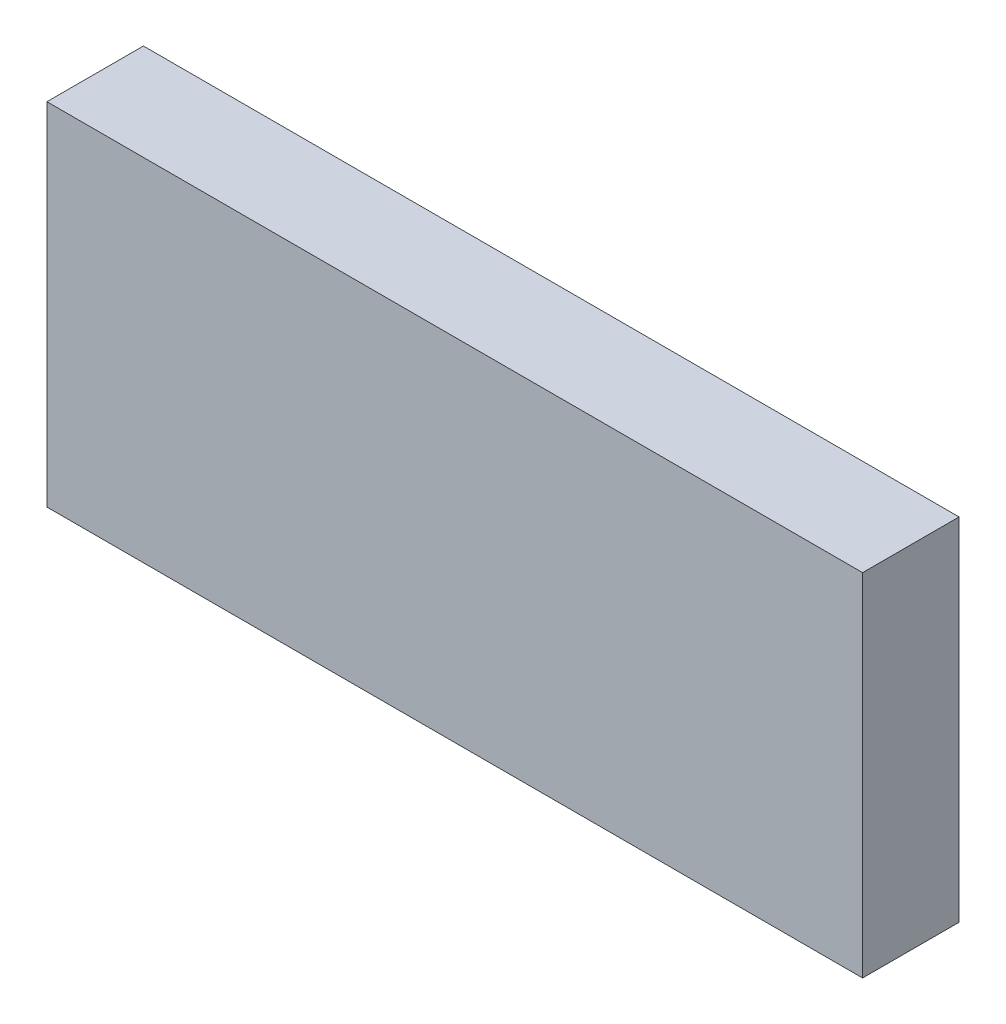
ISO-10303-21;
HEADER;
FILE_DESCRIPTION(('STEP AP214'),'2;1');
FILE_NAME('part.step','',(''),(''),'','','');
FILE_SCHEMA(('AUTOMOTIVE_DESIGN { 1 0 10303 214 1 1 1 1 }'));
ENDSEC;
DATA;
#1=APPLICATION_CONTEXT('core data for automotive mechanical design processes');
#2=APPLICATION_PROTOCOL_DEFINITION('international standard','automotive_design',2000,#1);
#3=PRODUCT_CONTEXT('',#1,'mechanical');
#4=PRODUCT('Part','Part','',(#3));
#5=PRODUCT_RELATED_PRODUCT_CATEGORY('part','',(#4));
#6=PRODUCT_DEFINITION_FORMATION('','',#4);
#7=PRODUCT_DEFINITION_CONTEXT('part definition',#1,'design');
#8=PRODUCT_DEFINITION('design','',#6,#7);
#9=PRODUCT_DEFINITION_SHAPE('','',#8);
#10=(LENGTH_UNIT() NAMED_UNIT(*) SI_UNIT(.MILLI.,.METRE.));
#11=(NAMED_UNIT(*) PLANE_ANGLE_UNIT() SI_UNIT($,.RADIAN.));
#12=(NAMED_UNIT(*) SI_UNIT($,.STERADIAN.) SOLID_ANGLE_UNIT());
#13=UNCERTAINTY_MEASURE_WITH_UNIT(LENGTH_MEASURE(1.E-05),#10,'distance_accuracy_value','');
#14=(GEOMETRIC_REPRESENTATION_CONTEXT(3) GLOBAL_UNCERTAINTY_ASSIGNED_CONTEXT((#13)) GLOBAL_UNIT_ASSIGNED_CONTEXT((#10,
#11,#12)) REPRESENTATION_CONTEXT('',''));
#15=CARTESIAN_POINT('',(0.,0.,0.));
#16=DIRECTION('',(0.,0.,1.));
#17=DIRECTION('',(1.,0.,0.));
#18=AXIS2_PLACEMENT_3D('',#15,#16,#17);
#19=CARTESIAN_POINT('',(3291.814453,0.,0.));
#20=DIRECTION('',(1.,0.,0.));
#21=DIRECTION('',(0.,0.,-1.));
#22=AXIS2_PLACEMENT_3D('',#19,#20,#21);
#23=PLANE('',#22);
#24=DIRECTION('',(0.,1.,0.));
#25=VECTOR('',#24,1.);
#26=CARTESIAN_POINT('',(3291.814453,0.,-1501.));
#27=LINE('',#26,#25);
#28=CARTESIAN_POINT('',(3291.814453,-2100.673096,-1501.));
#29=VERTEX_POINT('',#28);
#30=CARTESIAN_POINT('',(3291.814453,1611.235962,-1501.));
#31=VERTEX_POINT('',#30);
#32=EDGE_CURVE('E74',#29,#31,#27,.T.);
#33=ORIENTED_EDGE('',*,*,#32,.T.);
#34=DIRECTION('',(0.,0.,-1.));
#35=VECTOR('',#34,1.);
#36=CARTESIAN_POINT('',(3291.814453,1611.235962,0.));
#37=LINE('',#36,#35);
#38=CARTESIAN_POINT('',(3291.814453,1611.235962,-481.));
#39=VERTEX_POINT('',#38);
#40=EDGE_CURVE('E60',#31,#39,#37,.F.);
#41=ORIENTED_EDGE('',*,*,#40,.T.);
#42=DIRECTION('',(0.,1.,0.));
#43=VECTOR('',#42,1.);
#44=CARTESIAN_POINT('',(3291.814453,0.,-481.));
#45=LINE('',#44,#43);
#46=CARTESIAN_POINT('',(3291.814453,-2100.673096,-481.));
#47=VERTEX_POINT('',#46);
#48=EDGE_CURVE('E20',#39,#47,#45,.F.);
#49=ORIENTED_EDGE('',*,*,#48,.T.);
#50=DIRECTION('',(0.,0.,1.));
#51=VECTOR('',#50,1.);
#52=CARTESIAN_POINT('',(3291.814453,-2100.673096,0.));
#53=LINE('',#52,#51);
#54=EDGE_CURVE('E55',#47,#29,#53,.F.);
#55=ORIENTED_EDGE('',*,*,#54,.T.);
#56=EDGE_LOOP('',(#33,#41,#49,#55));
#57=FACE_BOUND('',#56,.T.);
#58=ADVANCED_FACE('F17',(#57),#23,.T.);
#59=CARTESIAN_POINT('',(0.,0.,-481.));
#60=DIRECTION('',(0.,0.,1.));
#61=DIRECTION('',(1.,0.,0.));
#62=AXIS2_PLACEMENT_3D('',#59,#60,#61);
#63=PLANE('',#62);
#64=DIRECTION('',(1.,0.,0.));
#65=VECTOR('',#64,1.);
#66=CARTESIAN_POINT('',(0.,-2100.673096,-481.));
#67=LINE('',#66,#65);
#68=CARTESIAN_POINT('',(-5332.509766,-2100.673096,-481.));
#69=VERTEX_POINT('',#68);
#70=EDGE_CURVE('E63',#69,#47,#67,.T.);
#71=ORIENTED_EDGE('',*,*,#70,.T.);
#72=ORIENTED_EDGE('',*,*,#48,.F.);
#73=DIRECTION('',(1.,0.,0.));
#74=VECTOR('',#73,1.);
#75=CARTESIAN_POINT('',(0.,1611.235962,-481.));
#76=LINE('',#75,#74);
#77=CARTESIAN_POINT('',(-5332.509766,1611.235962,-481.));
#78=VERTEX_POINT('',#77);
#79=EDGE_CURVE('E78',#39,#78,#76,.F.);
#80=ORIENTED_EDGE('',*,*,#79,.T.);
#81=DIRECTION('',(0.,1.,0.));
#82=VECTOR('',#81,1.);
#83=CARTESIAN_POINT('',(-5332.509766,0.,-481.));
#84=LINE('',#83,#82);
#85=EDGE_CURVE('E67',#78,#69,#84,.F.);
#86=ORIENTED_EDGE('',*,*,#85,.T.);
#87=EDGE_LOOP('',(#71,#72,#80,#86));
#88=FACE_BOUND('',#87,.T.);
#89=ADVANCED_FACE('F65',(#88),#63,.T.);
#90=CARTESIAN_POINT('',(0.,-2100.673096,0.));
#91=DIRECTION('',(0.,1.,0.));
#92=DIRECTION('',(0.,0.,1.));
#93=AXIS2_PLACEMENT_3D('',#90,#91,#92);
#94=PLANE('',#93);
#95=DIRECTION('',(1.,0.,0.));
#96=VECTOR('',#95,1.);
#97=CARTESIAN_POINT('',(0.,-2100.673096,-1501.));
#98=LINE('',#97,#96);
#99=CARTESIAN_POINT('',(-5332.509766,-2100.673096,-1501.));
#100=VERTEX_POINT('',#99);
#101=EDGE_CURVE('E71',#100,#29,#98,.T.);
#102=ORIENTED_EDGE('',*,*,#101,.T.);
#103=ORIENTED_EDGE('',*,*,#54,.F.);
#104=ORIENTED_EDGE('',*,*,#70,.F.);
#105=DIRECTION('',(0.,0.,1.));
#106=VECTOR('',#105,1.);
#107=CARTESIAN_POINT('',(-5332.509766,-2100.673096,0.));
#108=LINE('',#107,#106);
#109=EDGE_CURVE('E84',#69,#100,#108,.F.);
#110=ORIENTED_EDGE('',*,*,#109,.T.);
#111=EDGE_LOOP('',(#102,#103,#104,#110));
#112=FACE_BOUND('',#111,.T.);
#113=ADVANCED_FACE('F70',(#112),#94,.F.);
#114=CARTESIAN_POINT('',(0.,0.,-1501.));
#115=DIRECTION('',(0.,0.,1.));
#116=DIRECTION('',(1.,0.,0.));
#117=AXIS2_PLACEMENT_3D('',#114,#115,#116);
#118=PLANE('',#117);
#119=ORIENTED_EDGE('',*,*,#32,.F.);
#120=ORIENTED_EDGE('',*,*,#101,.F.);
#121=DIRECTION('',(0.,1.,0.));
#122=VECTOR('',#121,1.);
#123=CARTESIAN_POINT('',(-5332.509766,0.,-1501.));
#124=LINE('',#123,#122);
#125=CARTESIAN_POINT('',(-5332.509766,1611.235962,-1501.));
#126=VERTEX_POINT('',#125);
#127=EDGE_CURVE('E26',#100,#126,#124,.T.);
#128=ORIENTED_EDGE('',*,*,#127,.T.);
#129=DIRECTION('',(1.,0.,0.));
#130=VECTOR('',#129,1.);
#131=CARTESIAN_POINT('',(0.,1611.235962,-1501.));
#132=LINE('',#131,#130);
#133=EDGE_CURVE('E80',#126,#31,#132,.T.);
#134=ORIENTED_EDGE('',*,*,#133,.T.);
#135=EDGE_LOOP('',(#119,#120,#128,#134));
#136=FACE_BOUND('',#135,.T.);
#137=ADVANCED_FACE('F87',(#136),#118,.F.);
#138=CARTESIAN_POINT('',(0.,1611.235962,0.));
#139=DIRECTION('',(0.,-1.,0.));
#140=DIRECTION('',(0.,0.,-1.));
#141=AXIS2_PLACEMENT_3D('',#138,#139,#140);
#142=PLANE('',#141);
#143=ORIENTED_EDGE('',*,*,#133,.F.);
#144=DIRECTION('',(0.,0.,1.));
#145=VECTOR('',#144,1.);
#146=CARTESIAN_POINT('',(-5332.509766,1611.235962,0.));
#147=LINE('',#146,#145);
#148=EDGE_CURVE('E11',#126,#78,#147,.T.);
#149=ORIENTED_EDGE('',*,*,#148,.T.);
#150=ORIENTED_EDGE('',*,*,#79,.F.);
#151=ORIENTED_EDGE('',*,*,#40,.F.);
#152=EDGE_LOOP('',(#143,#149,#150,#151));
#153=FACE_BOUND('',#152,.T.);
#154=ADVANCED_FACE('F91',(#153),#142,.F.);
#155=CARTESIAN_POINT('',(-5332.509766,0.,0.));
#156=DIRECTION('',(-1.,0.,0.));
#157=DIRECTION('',(0.,0.,1.));
#158=AXIS2_PLACEMENT_3D('',#155,#156,#157);
#159=PLANE('',#158);
#160=ORIENTED_EDGE('',*,*,#127,.F.);
#161=ORIENTED_EDGE('',*,*,#109,.F.);
#162=ORIENTED_EDGE('',*,*,#85,.F.);
#163=ORIENTED_EDGE('',*,*,#148,.F.);
#164=EDGE_LOOP('',(#160,#161,#162,#163));
#165=FACE_BOUND('',#164,.T.);
#166=ADVANCED_FACE('F89',(#165),#159,.T.);
#167=CLOSED_SHELL('',(#58,#89,#113,#137,#154,#166));
#168=MANIFOLD_SOLID_BREP('B1',#167);
#169=ADVANCED_BREP_SHAPE_REPRESENTATION('',(#18,#168),#14);
#170=SHAPE_DEFINITION_REPRESENTATION(#9,#169);
ENDSEC;
END-ISO-10303-21;
